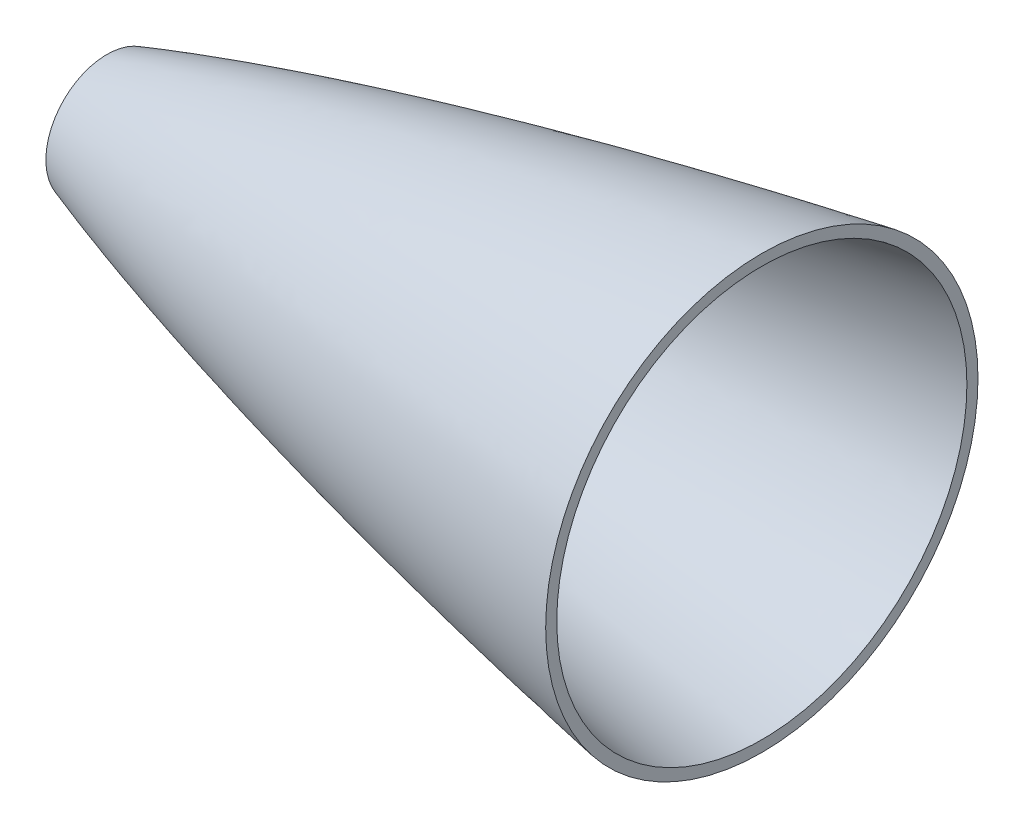
ISO-10303-21;
HEADER;
FILE_DESCRIPTION(('STEP AP214'),'2;1');
FILE_NAME('part.step','',(''),(''),'','','');
FILE_SCHEMA(('AUTOMOTIVE_DESIGN { 1 0 10303 214 1 1 1 1 }'));
ENDSEC;
DATA;
#1=APPLICATION_CONTEXT('core data for automotive mechanical design processes');
#2=APPLICATION_PROTOCOL_DEFINITION('international standard','automotive_design',2000,#1);
#3=PRODUCT_CONTEXT('',#1,'mechanical');
#4=PRODUCT('Part','Part','',(#3));
#5=PRODUCT_RELATED_PRODUCT_CATEGORY('part','',(#4));
#6=PRODUCT_DEFINITION_FORMATION('','',#4);
#7=PRODUCT_DEFINITION_CONTEXT('part definition',#1,'design');
#8=PRODUCT_DEFINITION('design','',#6,#7);
#9=PRODUCT_DEFINITION_SHAPE('','',#8);
#10=(LENGTH_UNIT() NAMED_UNIT(*) SI_UNIT(.MILLI.,.METRE.));
#11=(NAMED_UNIT(*) PLANE_ANGLE_UNIT() SI_UNIT($,.RADIAN.));
#12=(NAMED_UNIT(*) SI_UNIT($,.STERADIAN.) SOLID_ANGLE_UNIT());
#13=UNCERTAINTY_MEASURE_WITH_UNIT(LENGTH_MEASURE(1.E-05),#10,'distance_accuracy_value','');
#14=(GEOMETRIC_REPRESENTATION_CONTEXT(3) GLOBAL_UNCERTAINTY_ASSIGNED_CONTEXT((#13)) GLOBAL_UNIT_ASSIGNED_CONTEXT((#10,
#11,#12)) REPRESENTATION_CONTEXT('',''));
#15=CARTESIAN_POINT('',(0.,0.,0.));
#16=DIRECTION('',(0.,0.,1.));
#17=DIRECTION('',(1.,0.,0.));
#18=AXIS2_PLACEMENT_3D('',#15,#16,#17);
#19=CARTESIAN_POINT('',(457.2,88.9151474306752,0.));
#20=CARTESIAN_POINT('',(455.946325970131,88.9096070595816,0.));
#21=CARTESIAN_POINT('',(453.439259358558,88.8670591141968,0.));
#22=CARTESIAN_POINT('',(448.426238411328,88.7337773947161,0.));
#23=CARTESIAN_POINT('',(439.73839281718,88.3857521285292,0.));
#24=CARTESIAN_POINT('',(428.633298536274,87.7894164542894,0.));
#25=CARTESIAN_POINT('',(411.444893999551,86.6327793707619,0.));
#26=CARTESIAN_POINT('',(389.441443153579,84.7940694843695,0.));
#27=CARTESIAN_POINT('',(363.808737294308,82.2338961157606,0.));
#28=CARTESIAN_POINT('',(334.566457513105,78.8280593272444,0.));
#29=CARTESIAN_POINT('',(305.377643317541,74.992305893388,0.));
#30=CARTESIAN_POINT('',(276.244707872545,70.7535830300126,0.));
#31=CARTESIAN_POINT('',(247.171268660131,66.1243959171367,0.));
#32=CARTESIAN_POINT('',(218.162700889625,61.1047240595085,0.));
#33=CARTESIAN_POINT('',(189.226352810735,55.6834645782928,0.));
#34=CARTESIAN_POINT('',(160.373138085459,49.8354605300759,0.));
#35=CARTESIAN_POINT('',(131.618382458485,43.5190500386218,0.));
#36=CARTESIAN_POINT('',(102.986961257339,36.6637158027097,0.));
#37=CARTESIAN_POINT('',(75.2291315334263,29.34260403624,0.));
#38=CARTESIAN_POINT('',(51.2280847232855,22.2453278220032,0.));
#39=CARTESIAN_POINT('',(32.1609199731866,15.8309473459927,0.));
#40=CARTESIAN_POINT('',(18.8818526621386,10.6607161614939,0.));
#41=CARTESIAN_POINT('',(11.1356400070898,7.19917025164617,0.));
#42=CARTESIAN_POINT('',(6.56443195126468,4.84554388103954,0.));
#43=CARTESIAN_POINT('',(4.24353193294884,3.47834755188173,0.));
#44=CARTESIAN_POINT('',(3.23765947503868,2.82723498943833,0.));
#45=CARTESIAN_POINT('',(2.95679087341137,2.63945943168812,0.));
#46=B_SPLINE_CURVE_WITH_KNOTS('',4,(#19,#20,#21,#22,#23,#24,#25,#26,#27,#28,#29,#30,#31,#32,#33,
#34,#35,#36,#37,#38,#39,#40,#41,#42,#43,#44,#45),.UNSPECIFIED.,.F.,.F.,(5,1,1,1,1,1,1,1,1,1,1,1,
1,1,1,1,1,1,1,1,1,1,1,5),(0.,0.0107028585408144,0.0214057170816288,0.0428114341632575,
0.0742270157557156,0.105642597348174,0.168473764273532,0.231304932082114,0.294136099101199,
0.356967264511137,0.419798428516133,0.482629593130158,0.54546076349562,0.608291924387174,
0.671123088525779,0.733954252495489,0.796785426569319,0.859616580073358,0.916172283638337,
0.947587760918424,0.968473522471574,0.981230284106354,0.988574031772078,0.991458376357514),.UNSPECIFIED.);
#47=CARTESIAN_POINT('',(457.2,0.,0.));
#48=DIRECTION('',(1.,0.,0.));
#49=AXIS1_PLACEMENT('',#47,#48);
#50=SURFACE_OF_REVOLUTION('',#46,#49);
#51=OFFSET_SURFACE('',#50,3.175,.F.);
#52=CARTESIAN_POINT('',(38.1,0.,0.));
#53=DIRECTION('',(1.,0.,0.));
#54=DIRECTION('',(0.,0.,-1.));
#55=AXIS2_PLACEMENT_3D('',#52,#53,#54);
#56=CIRCLE('',#55,14.3812283729996);
#57=CARTESIAN_POINT('',(38.1,0.,-14.3812283729996));
#58=VERTEX_POINT('',#57);
#59=EDGE_CURVE('E47',#58,#58,#56,.F.);
#60=ORIENTED_EDGE('',*,*,#59,.T.);
#61=EDGE_LOOP('',(#60));
#62=FACE_BOUND('',#61,.T.);
#63=CARTESIAN_POINT('',(228.6,0.,0.));
#64=DIRECTION('',(1.,0.,0.));
#65=DIRECTION('',(0.,0.,-1.));
#66=AXIS2_PLACEMENT_3D('',#63,#64,#65);
#67=CIRCLE('',#66,59.6491220098759);
#68=CARTESIAN_POINT('',(228.6,0.,-59.6491220098759));
#69=VERTEX_POINT('',#68);
#70=EDGE_CURVE('E42',#69,#69,#67,.F.);
#71=ORIENTED_EDGE('',*,*,#70,.F.);
#72=EDGE_LOOP('',(#71));
#73=FACE_BOUND('',#72,.T.);
#74=ADVANCED_FACE('F33',(#62,#73),#51,.T.);
#75=CARTESIAN_POINT('',(228.6,85.5016324990525,-6.39090928044361));
#76=DIRECTION('',(1.,0.,0.));
#77=DIRECTION('',(0.,0.,-1.));
#78=AXIS2_PLACEMENT_3D('',#75,#76,#77);
#79=PLANE('',#78);
#80=CARTESIAN_POINT('',(228.6,0.,0.));
#81=DIRECTION('',(1.,0.,0.));
#82=DIRECTION('',(0.,0.,-1.));
#83=AXIS2_PLACEMENT_3D('',#80,#81,#82);
#84=CIRCLE('',#83,62.8724960821944);
#85=CARTESIAN_POINT('',(228.6,0.,-62.8724960821944));
#86=VERTEX_POINT('',#85);
#87=EDGE_CURVE('E10',#86,#86,#84,.F.);
#88=ORIENTED_EDGE('',*,*,#87,.F.);
#89=EDGE_LOOP('',(#88));
#90=FACE_BOUND('',#89,.T.);
#91=ORIENTED_EDGE('',*,*,#70,.T.);
#92=EDGE_LOOP('',(#91));
#93=FACE_BOUND('',#92,.T.);
#94=ADVANCED_FACE('F63',(#90,#93),#79,.T.);
#95=CARTESIAN_POINT('',(457.2,88.9151474306752,0.));
#96=CARTESIAN_POINT('',(455.946325970131,88.9096070595816,0.));
#97=CARTESIAN_POINT('',(453.439259358558,88.8670591141968,0.));
#98=CARTESIAN_POINT('',(448.426238411328,88.7337773947161,0.));
#99=CARTESIAN_POINT('',(439.73839281718,88.3857521285292,0.));
#100=CARTESIAN_POINT('',(428.633298536274,87.7894164542894,0.));
#101=CARTESIAN_POINT('',(411.444893999551,86.6327793707619,0.));
#102=CARTESIAN_POINT('',(389.441443153579,84.7940694843695,0.));
#103=CARTESIAN_POINT('',(363.808737294308,82.2338961157606,0.));
#104=CARTESIAN_POINT('',(334.566457513105,78.8280593272444,0.));
#105=CARTESIAN_POINT('',(305.377643317541,74.992305893388,0.));
#106=CARTESIAN_POINT('',(276.244707872545,70.7535830300126,0.));
#107=CARTESIAN_POINT('',(247.171268660131,66.1243959171367,0.));
#108=CARTESIAN_POINT('',(218.162700889625,61.1047240595085,0.));
#109=CARTESIAN_POINT('',(189.226352810735,55.6834645782928,0.));
#110=CARTESIAN_POINT('',(160.373138085459,49.8354605300759,0.));
#111=CARTESIAN_POINT('',(131.618382458485,43.5190500386218,0.));
#112=CARTESIAN_POINT('',(102.986961257339,36.6637158027097,0.));
#113=CARTESIAN_POINT('',(75.2291315334263,29.34260403624,0.));
#114=CARTESIAN_POINT('',(51.2280847232855,22.2453278220032,0.));
#115=CARTESIAN_POINT('',(32.1609199731866,15.8309473459927,0.));
#116=CARTESIAN_POINT('',(18.8818526621386,10.6607161614939,0.));
#117=CARTESIAN_POINT('',(11.1356400070898,7.19917025164617,0.));
#118=CARTESIAN_POINT('',(6.41553741622741,4.76888097271789,0.));
#119=CARTESIAN_POINT('',(3.70040498934197,3.15649989124108,0.));
#120=CARTESIAN_POINT('',(2.1712436943493,2.11577541374487,0.));
#121=CARTESIAN_POINT('',(1.29726517344645,1.43712408397375,0.));
#122=CARTESIAN_POINT('',(0.796656587163147,0.996403728119644,0.));
#123=CARTESIAN_POINT('',(0.508236086993361,0.709975777371162,0.));
#124=CARTESIAN_POINT('',(0.336940369552542,0.5207345708639,0.));
#125=CARTESIAN_POINT('',(0.219057570584673,0.377905450824387,0.));
#126=CARTESIAN_POINT('',(0.133875618926122,0.263125341051019,0.));
#127=CARTESIAN_POINT('',(0.06950687304492,0.163021890873473,0.));
#128=CARTESIAN_POINT('',(0.025920332395015,0.0786931532777685,0.));
#129=CARTESIAN_POINT('',(0.00817122284619331,0.0346034081490176,0.));
#130=CARTESIAN_POINT('',(0.00225195502300941,0.0116765884656801,0.));
#131=CARTESIAN_POINT('',(0.,0.,0.));
#132=B_SPLINE_CURVE_WITH_KNOTS('',4,(#95,#96,#97,#98,#99,#100,#101,#102,#103,#104,#105,#106,
#107,#108,#109,#110,#111,#112,#113,#114,#115,#116,#117,#118,#119,#120,#121,#122,#123,#124,#125,
#126,#127,#128,#129,#130,#131),.UNSPECIFIED.,.F.,.F.,(5,1,1,1,1,1,1,1,1,1,1,1,1,1,1,1,1,1,1,1,1,
1,1,1,1,1,1,1,1,1,1,1,1,5),(0.,0.0107028585408144,0.0214057170816288,0.0428114341632575,
0.0742270157557156,0.105642597348174,0.168473764273532,0.231304932082114,0.294136099101199,
0.356967264511137,0.419798428516133,0.482629593130158,0.54546076349562,0.608291924387174,
0.671123088525779,0.733954252495489,0.796785426569319,0.859616580073358,0.916172283638337,
0.947587760918424,0.968473522471574,0.981230284106354,0.988574031772078,0.992887341044273,
0.995416079253204,0.997012129469831,0.998014752370499,0.998578001550583,0.998884285300425,
0.999190569050268,0.999595284525134,0.999797642262567,0.999898821131283,1.),.UNSPECIFIED.);
#133=CARTESIAN_POINT('',(457.2,0.,0.));
#134=DIRECTION('',(1.,0.,0.));
#135=AXIS1_PLACEMENT('',#133,#134);
#136=SURFACE_OF_REVOLUTION('',#132,#135);
#137=CARTESIAN_POINT('',(38.1,0.,0.));
#138=DIRECTION('',(1.,0.,0.));
#139=DIRECTION('',(0.,0.,-1.));
#140=AXIS2_PLACEMENT_3D('',#137,#138,#139);
#141=CIRCLE('',#140,17.7393092495634);
#142=CARTESIAN_POINT('',(38.1,0.,-17.7393092495634));
#143=VERTEX_POINT('',#142);
#144=EDGE_CURVE('E38',#143,#143,#141,.F.);
#145=ORIENTED_EDGE('',*,*,#144,.F.);
#146=EDGE_LOOP('',(#145));
#147=FACE_BOUND('',#146,.T.);
#148=ORIENTED_EDGE('',*,*,#87,.T.);
#149=EDGE_LOOP('',(#148));
#150=FACE_BOUND('',#149,.T.);
#151=ADVANCED_FACE('F35',(#147,#150),#136,.F.);
#152=CARTESIAN_POINT('',(38.1,0.,0.));
#153=DIRECTION('',(1.,0.,0.));
#154=DIRECTION('',(0.,0.,-1.));
#155=AXIS2_PLACEMENT_3D('',#152,#153,#154);
#156=PLANE('',#155);
#157=ORIENTED_EDGE('',*,*,#144,.T.);
#158=EDGE_LOOP('',(#157));
#159=FACE_BOUND('',#158,.T.);
#160=ORIENTED_EDGE('',*,*,#59,.F.);
#161=EDGE_LOOP('',(#160));
#162=FACE_BOUND('',#161,.T.);
#163=ADVANCED_FACE('F68',(#159,#162),#156,.F.);
#164=CLOSED_SHELL('',(#74,#94,#151,#163));
#165=MANIFOLD_SOLID_BREP('B2',#164);
#166=ADVANCED_BREP_SHAPE_REPRESENTATION('',(#18,#165),#14);
#167=SHAPE_DEFINITION_REPRESENTATION(#9,#166);
ENDSEC;
END-ISO-10303-21;
